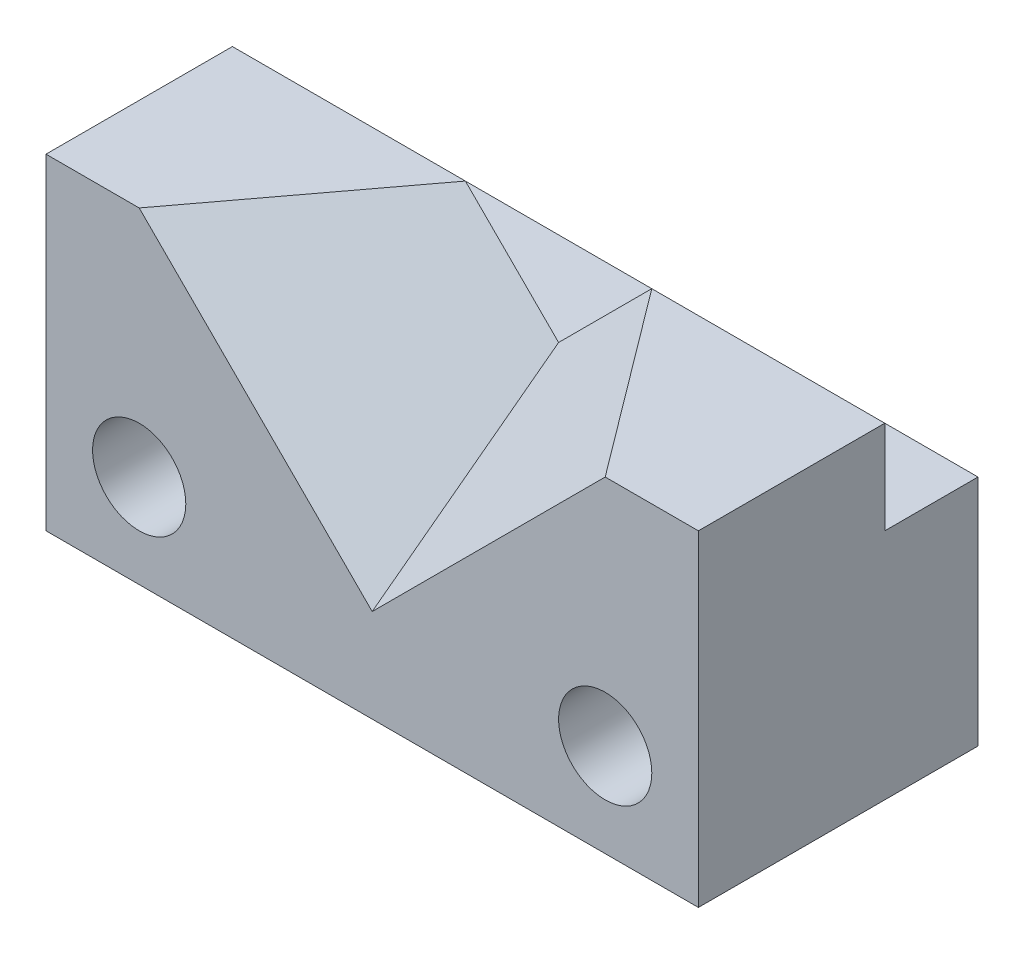
ISO-10303-21;
HEADER;
FILE_DESCRIPTION(('STEP AP214'),'2;1');
FILE_NAME('part.step','',(''),(''),'','','');
FILE_SCHEMA(('AUTOMOTIVE_DESIGN { 1 0 10303 214 1 1 1 1 }'));
ENDSEC;
DATA;
#1=APPLICATION_CONTEXT('core data for automotive mechanical design processes');
#2=APPLICATION_PROTOCOL_DEFINITION('international standard','automotive_design',2000,#1);
#3=PRODUCT_CONTEXT('',#1,'mechanical');
#4=PRODUCT('Part','Part','',(#3));
#5=PRODUCT_RELATED_PRODUCT_CATEGORY('part','',(#4));
#6=PRODUCT_DEFINITION_FORMATION('','',#4);
#7=PRODUCT_DEFINITION_CONTEXT('part definition',#1,'design');
#8=PRODUCT_DEFINITION('design','',#6,#7);
#9=PRODUCT_DEFINITION_SHAPE('','',#8);
#10=(LENGTH_UNIT() NAMED_UNIT(*) SI_UNIT(.MILLI.,.METRE.));
#11=(NAMED_UNIT(*) PLANE_ANGLE_UNIT() SI_UNIT($,.RADIAN.));
#12=(NAMED_UNIT(*) SI_UNIT($,.STERADIAN.) SOLID_ANGLE_UNIT());
#13=UNCERTAINTY_MEASURE_WITH_UNIT(LENGTH_MEASURE(1.E-05),#10,'distance_accuracy_value','');
#14=(GEOMETRIC_REPRESENTATION_CONTEXT(3) GLOBAL_UNCERTAINTY_ASSIGNED_CONTEXT((#13)) GLOBAL_UNIT_ASSIGNED_CONTEXT((#10,
#11,#12)) REPRESENTATION_CONTEXT('',''));
#15=CARTESIAN_POINT('',(0.,0.,0.));
#16=DIRECTION('',(0.,0.,1.));
#17=DIRECTION('',(1.,0.,0.));
#18=AXIS2_PLACEMENT_3D('',#15,#16,#17);
#19=CARTESIAN_POINT('',(70.,35.,0.));
#20=DIRECTION('',(0.,-1.,0.));
#21=DIRECTION('',(0.,0.,-1.));
#22=AXIS2_PLACEMENT_3D('',#19,#20,#21);
#23=PLANE('',#22);
#24=DIRECTION('',(0.6,0.,0.8));
#25=VECTOR('',#24,1.);
#26=CARTESIAN_POINT('',(45.,35.,-20.));
#27=LINE('',#26,#25);
#28=CARTESIAN_POINT('',(45.,35.,-20.));
#29=VERTEX_POINT('',#28);
#30=CARTESIAN_POINT('',(60.,35.,0.));
#31=VERTEX_POINT('',#30);
#32=EDGE_CURVE('E109',#29,#31,#27,.T.);
#33=ORIENTED_EDGE('',*,*,#32,.T.);
#34=DIRECTION('',(-1.,0.,0.));
#35=VECTOR('',#34,1.);
#36=CARTESIAN_POINT('',(70.,35.,0.));
#37=LINE('',#36,#35);
#38=CARTESIAN_POINT('',(70.,35.,0.));
#39=VERTEX_POINT('',#38);
#40=EDGE_CURVE('E125',#39,#31,#37,.T.);
#41=ORIENTED_EDGE('',*,*,#40,.F.);
#42=DIRECTION('',(0.,0.,1.));
#43=VECTOR('',#42,1.);
#44=CARTESIAN_POINT('',(70.,35.,0.));
#45=LINE('',#44,#43);
#46=CARTESIAN_POINT('',(70.,35.,-20.));
#47=VERTEX_POINT('',#46);
#48=EDGE_CURVE('E195',#47,#39,#45,.T.);
#49=ORIENTED_EDGE('',*,*,#48,.F.);
#50=DIRECTION('',(-1.,0.,0.));
#51=VECTOR('',#50,1.);
#52=CARTESIAN_POINT('',(70.,35.,-20.));
#53=LINE('',#52,#51);
#54=EDGE_CURVE('E42',#47,#29,#53,.T.);
#55=ORIENTED_EDGE('',*,*,#54,.T.);
#56=EDGE_LOOP('',(#33,#41,#49,#55));
#57=FACE_BOUND('',#56,.T.);
#58=ADVANCED_FACE('F39',(#57),#23,.F.);
#59=CARTESIAN_POINT('',(0.,35.,0.));
#60=DIRECTION('',(0.,0.,-1.));
#61=DIRECTION('',(-1.,0.,0.));
#62=AXIS2_PLACEMENT_3D('',#59,#60,#61);
#63=PLANE('',#62);
#64=CARTESIAN_POINT('',(60.,10.,0.));
#65=DIRECTION('',(0.,0.,1.));
#66=DIRECTION('',(1.,0.,0.));
#67=AXIS2_PLACEMENT_3D('',#64,#65,#66);
#68=CIRCLE('',#67,5.);
#69=CARTESIAN_POINT('',(65.,10.,0.));
#70=VERTEX_POINT('',#69);
#71=EDGE_CURVE('E225',#70,#70,#68,.T.);
#72=ORIENTED_EDGE('',*,*,#71,.F.);
#73=EDGE_LOOP('',(#72));
#74=FACE_BOUND('',#73,.T.);
#75=CARTESIAN_POINT('',(10.,10.,0.));
#76=DIRECTION('',(0.,0.,1.));
#77=DIRECTION('',(1.,0.,0.));
#78=AXIS2_PLACEMENT_3D('',#75,#76,#77);
#79=CIRCLE('',#78,5.);
#80=CARTESIAN_POINT('',(15.,10.,0.));
#81=VERTEX_POINT('',#80);
#82=EDGE_CURVE('E216',#81,#81,#79,.T.);
#83=ORIENTED_EDGE('',*,*,#82,.F.);
#84=EDGE_LOOP('',(#83));
#85=FACE_BOUND('',#84,.T.);
#86=DIRECTION('',(-0.707106781186547,-0.707106781186548,0.));
#87=VECTOR('',#86,1.);
#88=CARTESIAN_POINT('',(60.,35.,0.));
#89=LINE('',#88,#87);
#90=CARTESIAN_POINT('',(35.,10.,0.));
#91=VERTEX_POINT('',#90);
#92=EDGE_CURVE('E56',#31,#91,#89,.T.);
#93=ORIENTED_EDGE('',*,*,#92,.T.);
#94=DIRECTION('',(0.707106781186547,-0.707106781186548,0.));
#95=VECTOR('',#94,1.);
#96=CARTESIAN_POINT('',(10.,35.,0.));
#97=LINE('',#96,#95);
#98=CARTESIAN_POINT('',(10.,35.,0.));
#99=VERTEX_POINT('',#98);
#100=EDGE_CURVE('E147',#99,#91,#97,.T.);
#101=ORIENTED_EDGE('',*,*,#100,.F.);
#102=DIRECTION('',(1.,0.,0.));
#103=VECTOR('',#102,1.);
#104=CARTESIAN_POINT('',(0.,35.,0.));
#105=LINE('',#104,#103);
#106=CARTESIAN_POINT('',(0.,35.,0.));
#107=VERTEX_POINT('',#106);
#108=EDGE_CURVE('E163',#107,#99,#105,.T.);
#109=ORIENTED_EDGE('',*,*,#108,.F.);
#110=DIRECTION('',(0.,-1.,0.));
#111=VECTOR('',#110,1.);
#112=CARTESIAN_POINT('',(0.,35.,0.));
#113=LINE('',#112,#111);
#114=CARTESIAN_POINT('',(0.,0.,0.));
#115=VERTEX_POINT('',#114);
#116=EDGE_CURVE('E179',#107,#115,#113,.T.);
#117=ORIENTED_EDGE('',*,*,#116,.T.);
#118=DIRECTION('',(1.,0.,0.));
#119=VECTOR('',#118,1.);
#120=CARTESIAN_POINT('',(0.,0.,0.));
#121=LINE('',#120,#119);
#122=CARTESIAN_POINT('',(70.,0.,0.));
#123=VERTEX_POINT('',#122);
#124=EDGE_CURVE('E176',#115,#123,#121,.T.);
#125=ORIENTED_EDGE('',*,*,#124,.T.);
#126=DIRECTION('',(0.,-1.,0.));
#127=VECTOR('',#126,1.);
#128=CARTESIAN_POINT('',(70.,35.,0.));
#129=LINE('',#128,#127);
#130=EDGE_CURVE('E167',#39,#123,#129,.T.);
#131=ORIENTED_EDGE('',*,*,#130,.F.);
#132=ORIENTED_EDGE('',*,*,#40,.T.);
#133=EDGE_LOOP('',(#93,#101,#109,#117,#125,#131,#132));
#134=FACE_BOUND('',#133,.T.);
#135=ADVANCED_FACE('F233',(#74,#85,#134),#63,.F.);
#136=CARTESIAN_POINT('',(70.,25.,-20.));
#137=DIRECTION('',(0.,0.,-1.));
#138=DIRECTION('',(-1.,0.,0.));
#139=AXIS2_PLACEMENT_3D('',#136,#137,#138);
#140=PLANE('',#139);
#141=DIRECTION('',(-1.,0.,0.));
#142=VECTOR('',#141,1.);
#143=CARTESIAN_POINT('',(70.,25.,-20.));
#144=LINE('',#143,#142);
#145=CARTESIAN_POINT('',(70.,25.,-20.));
#146=VERTEX_POINT('',#145);
#147=CARTESIAN_POINT('',(35.,25.,-20.));
#148=VERTEX_POINT('',#147);
#149=EDGE_CURVE('E114',#146,#148,#144,.T.);
#150=ORIENTED_EDGE('',*,*,#149,.T.);
#151=DIRECTION('',(0.707106781186547,0.707106781186548,0.));
#152=VECTOR('',#151,1.);
#153=CARTESIAN_POINT('',(52.5,42.5,-20.));
#154=LINE('',#153,#152);
#155=EDGE_CURVE('E105',#148,#29,#154,.T.);
#156=ORIENTED_EDGE('',*,*,#155,.T.);
#157=ORIENTED_EDGE('',*,*,#54,.F.);
#158=DIRECTION('',(0.,1.,0.));
#159=VECTOR('',#158,1.);
#160=CARTESIAN_POINT('',(70.,25.,-20.));
#161=LINE('',#160,#159);
#162=EDGE_CURVE('E120',#146,#47,#161,.T.);
#163=ORIENTED_EDGE('',*,*,#162,.F.);
#164=EDGE_LOOP('',(#150,#156,#157,#163));
#165=FACE_BOUND('',#164,.T.);
#166=ADVANCED_FACE('F118',(#165),#140,.T.);
#167=CARTESIAN_POINT('',(0.,35.,-30.));
#168=DIRECTION('',(0.,0.,1.));
#169=DIRECTION('',(1.,0.,0.));
#170=AXIS2_PLACEMENT_3D('',#167,#168,#169);
#171=PLANE('',#170);
#172=CARTESIAN_POINT('',(60.,10.,-30.));
#173=DIRECTION('',(0.,0.,1.));
#174=DIRECTION('',(1.,0.,0.));
#175=AXIS2_PLACEMENT_3D('',#172,#173,#174);
#176=CIRCLE('',#175,5.);
#177=CARTESIAN_POINT('',(65.,10.,-30.));
#178=VERTEX_POINT('',#177);
#179=EDGE_CURVE('E222',#178,#178,#176,.T.);
#180=ORIENTED_EDGE('',*,*,#179,.T.);
#181=EDGE_LOOP('',(#180));
#182=FACE_BOUND('',#181,.T.);
#183=CARTESIAN_POINT('',(10.,10.,-30.));
#184=DIRECTION('',(0.,0.,1.));
#185=DIRECTION('',(1.,0.,0.));
#186=AXIS2_PLACEMENT_3D('',#183,#184,#185);
#187=CIRCLE('',#186,5.);
#188=CARTESIAN_POINT('',(15.,10.,-30.));
#189=VERTEX_POINT('',#188);
#190=EDGE_CURVE('E210',#189,#189,#187,.T.);
#191=ORIENTED_EDGE('',*,*,#190,.T.);
#192=EDGE_LOOP('',(#191));
#193=FACE_BOUND('',#192,.T.);
#194=DIRECTION('',(-1.,0.,0.));
#195=VECTOR('',#194,1.);
#196=CARTESIAN_POINT('',(0.,25.,-30.));
#197=LINE('',#196,#195);
#198=CARTESIAN_POINT('',(70.,25.,-30.));
#199=VERTEX_POINT('',#198);
#200=CARTESIAN_POINT('',(0.,25.,-30.));
#201=VERTEX_POINT('',#200);
#202=EDGE_CURVE('E136',#199,#201,#197,.T.);
#203=ORIENTED_EDGE('',*,*,#202,.F.);
#204=DIRECTION('',(0.,-1.,0.));
#205=VECTOR('',#204,1.);
#206=CARTESIAN_POINT('',(70.,35.,-30.));
#207=LINE('',#206,#205);
#208=CARTESIAN_POINT('',(70.,0.,-30.));
#209=VERTEX_POINT('',#208);
#210=EDGE_CURVE('E113',#199,#209,#207,.T.);
#211=ORIENTED_EDGE('',*,*,#210,.T.);
#212=DIRECTION('',(-1.,0.,0.));
#213=VECTOR('',#212,1.);
#214=CARTESIAN_POINT('',(0.,0.,-30.));
#215=LINE('',#214,#213);
#216=CARTESIAN_POINT('',(0.,0.,-30.));
#217=VERTEX_POINT('',#216);
#218=EDGE_CURVE('E180',#209,#217,#215,.T.);
#219=ORIENTED_EDGE('',*,*,#218,.T.);
#220=DIRECTION('',(0.,-1.,0.));
#221=VECTOR('',#220,1.);
#222=CARTESIAN_POINT('',(0.,35.,-30.));
#223=LINE('',#222,#221);
#224=EDGE_CURVE('E175',#201,#217,#223,.T.);
#225=ORIENTED_EDGE('',*,*,#224,.F.);
#226=EDGE_LOOP('',(#203,#211,#219,#225));
#227=FACE_BOUND('',#226,.T.);
#228=ADVANCED_FACE('F251',(#182,#193,#227),#171,.F.);
#229=CARTESIAN_POINT('',(70.,35.,0.));
#230=DIRECTION('',(1.,0.,0.));
#231=DIRECTION('',(0.,0.,-1.));
#232=AXIS2_PLACEMENT_3D('',#229,#230,#231);
#233=PLANE('',#232);
#234=DIRECTION('',(0.,0.,1.));
#235=VECTOR('',#234,1.);
#236=CARTESIAN_POINT('',(70.,25.,-30.));
#237=LINE('',#236,#235);
#238=EDGE_CURVE('E184',#199,#146,#237,.T.);
#239=ORIENTED_EDGE('',*,*,#238,.T.);
#240=ORIENTED_EDGE('',*,*,#162,.T.);
#241=ORIENTED_EDGE('',*,*,#48,.T.);
#242=ORIENTED_EDGE('',*,*,#130,.T.);
#243=DIRECTION('',(0.,0.,1.));
#244=VECTOR('',#243,1.);
#245=CARTESIAN_POINT('',(70.,0.,0.));
#246=LINE('',#245,#244);
#247=EDGE_CURVE('E156',#209,#123,#246,.T.);
#248=ORIENTED_EDGE('',*,*,#247,.F.);
#249=ORIENTED_EDGE('',*,*,#210,.F.);
#250=EDGE_LOOP('',(#239,#240,#241,#242,#248,#249));
#251=FACE_BOUND('',#250,.T.);
#252=ADVANCED_FACE('F244',(#251),#233,.T.);
#253=CARTESIAN_POINT('',(0.,35.,0.));
#254=DIRECTION('',(0.,-1.,0.));
#255=DIRECTION('',(0.,0.,-1.));
#256=AXIS2_PLACEMENT_3D('',#253,#254,#255);
#257=PLANE('',#256);
#258=DIRECTION('',(-0.6,0.,0.8));
#259=VECTOR('',#258,1.);
#260=CARTESIAN_POINT('',(25.,35.,-20.));
#261=LINE('',#260,#259);
#262=CARTESIAN_POINT('',(25.,35.,-20.));
#263=VERTEX_POINT('',#262);
#264=EDGE_CURVE('E151',#263,#99,#261,.T.);
#265=ORIENTED_EDGE('',*,*,#264,.F.);
#266=DIRECTION('',(1.,0.,0.));
#267=VECTOR('',#266,1.);
#268=CARTESIAN_POINT('',(0.,35.,-20.));
#269=LINE('',#268,#267);
#270=CARTESIAN_POINT('',(0.,35.,-20.));
#271=VERTEX_POINT('',#270);
#272=EDGE_CURVE('E141',#271,#263,#269,.T.);
#273=ORIENTED_EDGE('',*,*,#272,.F.);
#274=DIRECTION('',(0.,0.,1.));
#275=VECTOR('',#274,1.);
#276=CARTESIAN_POINT('',(0.,35.,0.));
#277=LINE('',#276,#275);
#278=EDGE_CURVE('E164',#271,#107,#277,.T.);
#279=ORIENTED_EDGE('',*,*,#278,.T.);
#280=ORIENTED_EDGE('',*,*,#108,.T.);
#281=EDGE_LOOP('',(#265,#273,#279,#280));
#282=FACE_BOUND('',#281,.T.);
#283=ADVANCED_FACE('F235',(#282),#257,.F.);
#284=CARTESIAN_POINT('',(0.,25.,-20.));
#285=DIRECTION('',(0.,0.,1.));
#286=DIRECTION('',(1.,0.,0.));
#287=AXIS2_PLACEMENT_3D('',#284,#285,#286);
#288=PLANE('',#287);
#289=DIRECTION('',(-0.707106781186547,0.707106781186548,0.));
#290=VECTOR('',#289,1.);
#291=CARTESIAN_POINT('',(35.,25.,-20.));
#292=LINE('',#291,#290);
#293=EDGE_CURVE('E11',#148,#263,#292,.T.);
#294=ORIENTED_EDGE('',*,*,#293,.F.);
#295=DIRECTION('',(1.,0.,0.));
#296=VECTOR('',#295,1.);
#297=CARTESIAN_POINT('',(0.,25.,-20.));
#298=LINE('',#297,#296);
#299=CARTESIAN_POINT('',(0.,25.,-20.));
#300=VERTEX_POINT('',#299);
#301=EDGE_CURVE('E128',#300,#148,#298,.T.);
#302=ORIENTED_EDGE('',*,*,#301,.F.);
#303=DIRECTION('',(0.,1.,0.));
#304=VECTOR('',#303,1.);
#305=CARTESIAN_POINT('',(0.,25.,-20.));
#306=LINE('',#305,#304);
#307=EDGE_CURVE('E160',#300,#271,#306,.T.);
#308=ORIENTED_EDGE('',*,*,#307,.T.);
#309=ORIENTED_EDGE('',*,*,#272,.T.);
#310=EDGE_LOOP('',(#294,#302,#308,#309));
#311=FACE_BOUND('',#310,.T.);
#312=ADVANCED_FACE('F139',(#311),#288,.F.);
#313=CARTESIAN_POINT('',(0.,35.,0.));
#314=DIRECTION('',(1.,0.,0.));
#315=DIRECTION('',(0.,0.,-1.));
#316=AXIS2_PLACEMENT_3D('',#313,#314,#315);
#317=PLANE('',#316);
#318=ORIENTED_EDGE('',*,*,#278,.F.);
#319=ORIENTED_EDGE('',*,*,#307,.F.);
#320=DIRECTION('',(0.,0.,1.));
#321=VECTOR('',#320,1.);
#322=CARTESIAN_POINT('',(0.,25.,-30.));
#323=LINE('',#322,#321);
#324=EDGE_CURVE('E132',#201,#300,#323,.T.);
#325=ORIENTED_EDGE('',*,*,#324,.F.);
#326=ORIENTED_EDGE('',*,*,#224,.T.);
#327=DIRECTION('',(0.,0.,1.));
#328=VECTOR('',#327,1.);
#329=CARTESIAN_POINT('',(0.,0.,0.));
#330=LINE('',#329,#328);
#331=EDGE_CURVE('E171',#217,#115,#330,.T.);
#332=ORIENTED_EDGE('',*,*,#331,.T.);
#333=ORIENTED_EDGE('',*,*,#116,.F.);
#334=EDGE_LOOP('',(#318,#319,#325,#326,#332,#333));
#335=FACE_BOUND('',#334,.T.);
#336=ADVANCED_FACE('F238',(#335),#317,.F.);
#337=CARTESIAN_POINT('',(0.,0.,0.));
#338=DIRECTION('',(0.,-1.,0.));
#339=DIRECTION('',(0.,0.,-1.));
#340=AXIS2_PLACEMENT_3D('',#337,#338,#339);
#341=PLANE('',#340);
#342=ORIENTED_EDGE('',*,*,#331,.F.);
#343=ORIENTED_EDGE('',*,*,#218,.F.);
#344=ORIENTED_EDGE('',*,*,#247,.T.);
#345=ORIENTED_EDGE('',*,*,#124,.F.);
#346=EDGE_LOOP('',(#342,#343,#344,#345));
#347=FACE_BOUND('',#346,.T.);
#348=ADVANCED_FACE('F248',(#347),#341,.T.);
#349=CARTESIAN_POINT('',(0.,25.,0.));
#350=DIRECTION('',(0.,1.,0.));
#351=DIRECTION('',(0.,0.,1.));
#352=AXIS2_PLACEMENT_3D('',#349,#350,#351);
#353=PLANE('',#352);
#354=ORIENTED_EDGE('',*,*,#324,.T.);
#355=ORIENTED_EDGE('',*,*,#301,.T.);
#356=ORIENTED_EDGE('',*,*,#149,.F.);
#357=ORIENTED_EDGE('',*,*,#238,.F.);
#358=ORIENTED_EDGE('',*,*,#202,.T.);
#359=EDGE_LOOP('',(#354,#355,#356,#357,#358));
#360=FACE_BOUND('',#359,.T.);
#361=ADVANCED_FACE('F130',(#360),#353,.T.);
#362=CARTESIAN_POINT('',(17.5609756097561,17.5609756097561,13.1707317073171));
#363=DIRECTION('',(0.624695047554424,0.624695047554424,0.468521285665819));
#364=DIRECTION('',(-0.707106781186547,0.707106781186548,0.));
#365=AXIS2_PLACEMENT_3D('',#362,#363,#364);
#366=PLANE('',#365);
#367=ORIENTED_EDGE('',*,*,#264,.T.);
#368=ORIENTED_EDGE('',*,*,#100,.T.);
#369=DIRECTION('',(0.,0.6,-0.8));
#370=VECTOR('',#369,1.);
#371=CARTESIAN_POINT('',(35.,10.,0.));
#372=LINE('',#371,#370);
#373=EDGE_CURVE('E49',#91,#148,#372,.T.);
#374=ORIENTED_EDGE('',*,*,#373,.T.);
#375=ORIENTED_EDGE('',*,*,#293,.T.);
#376=EDGE_LOOP('',(#367,#368,#374,#375));
#377=FACE_BOUND('',#376,.T.);
#378=ADVANCED_FACE('F145',(#377),#366,.T.);
#379=CARTESIAN_POINT('',(52.4390243902439,17.5609756097561,13.1707317073171));
#380=DIRECTION('',(-0.624695047554424,0.624695047554424,0.468521285665819));
#381=DIRECTION('',(0.707106781186547,0.707106781186548,0.));
#382=AXIS2_PLACEMENT_3D('',#379,#380,#381);
#383=PLANE('',#382);
#384=ORIENTED_EDGE('',*,*,#32,.F.);
#385=ORIENTED_EDGE('',*,*,#155,.F.);
#386=ORIENTED_EDGE('',*,*,#373,.F.);
#387=ORIENTED_EDGE('',*,*,#92,.F.);
#388=EDGE_LOOP('',(#384,#385,#386,#387));
#389=FACE_BOUND('',#388,.T.);
#390=ADVANCED_FACE('F107',(#389),#383,.T.);
#391=CARTESIAN_POINT('',(10.,10.,-30.));
#392=DIRECTION('',(0.,0.,1.));
#393=DIRECTION('',(1.,0.,0.));
#394=AXIS2_PLACEMENT_3D('',#391,#392,#393);
#395=CYLINDRICAL_SURFACE('',#394,5.);
#396=ORIENTED_EDGE('',*,*,#190,.F.);
#397=EDGE_LOOP('',(#396));
#398=FACE_BOUND('',#397,.T.);
#399=ORIENTED_EDGE('',*,*,#82,.T.);
#400=EDGE_LOOP('',(#399));
#401=FACE_BOUND('',#400,.T.);
#402=ADVANCED_FACE('F271',(#398,#401),#395,.F.);
#403=CARTESIAN_POINT('',(60.,10.,-30.));
#404=DIRECTION('',(0.,0.,1.));
#405=DIRECTION('',(1.,0.,0.));
#406=AXIS2_PLACEMENT_3D('',#403,#404,#405);
#407=CYLINDRICAL_SURFACE('',#406,5.);
#408=ORIENTED_EDGE('',*,*,#179,.F.);
#409=EDGE_LOOP('',(#408));
#410=FACE_BOUND('',#409,.T.);
#411=ORIENTED_EDGE('',*,*,#71,.T.);
#412=EDGE_LOOP('',(#411));
#413=FACE_BOUND('',#412,.T.);
#414=ADVANCED_FACE('F276',(#410,#413),#407,.F.);
#415=CLOSED_SHELL('',(#58,#135,#166,#228,#252,#283,#312,#336,#348,#361,#378,#390,#402,#414));
#416=MANIFOLD_SOLID_BREP('B2',#415);
#417=ADVANCED_BREP_SHAPE_REPRESENTATION('',(#18,#416),#14);
#418=SHAPE_DEFINITION_REPRESENTATION(#9,#417);
ENDSEC;
END-ISO-10303-21;
